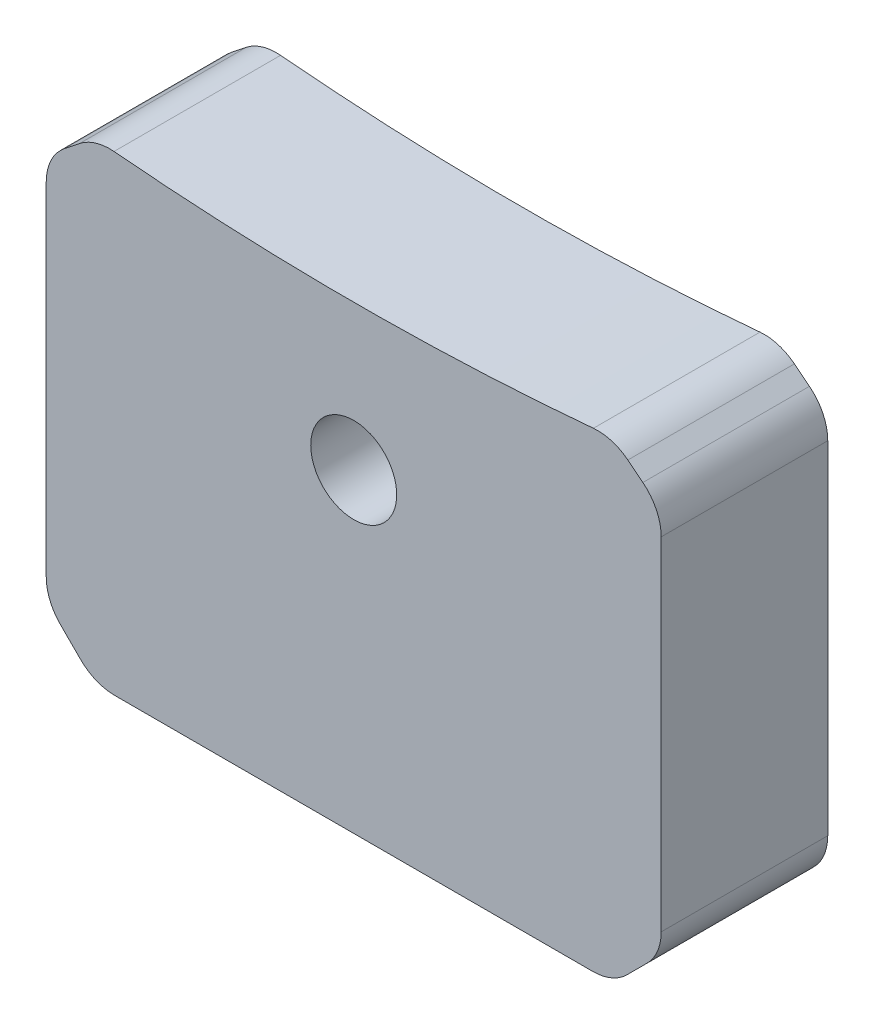
ISO-10303-21;
HEADER;
FILE_DESCRIPTION(('STEP AP214'),'2;1');
FILE_NAME('part.step','',(''),(''),'','','');
FILE_SCHEMA(('AUTOMOTIVE_DESIGN { 1 0 10303 214 1 1 1 1 }'));
ENDSEC;
DATA;
#1=APPLICATION_CONTEXT('core data for automotive mechanical design processes');
#2=APPLICATION_PROTOCOL_DEFINITION('international standard','automotive_design',2000,#1);
#3=PRODUCT_CONTEXT('',#1,'mechanical');
#4=PRODUCT('Part','Part','',(#3));
#5=PRODUCT_RELATED_PRODUCT_CATEGORY('part','',(#4));
#6=PRODUCT_DEFINITION_FORMATION('','',#4);
#7=PRODUCT_DEFINITION_CONTEXT('part definition',#1,'design');
#8=PRODUCT_DEFINITION('design','',#6,#7);
#9=PRODUCT_DEFINITION_SHAPE('','',#8);
#10=(LENGTH_UNIT() NAMED_UNIT(*) SI_UNIT(.MILLI.,.METRE.));
#11=(NAMED_UNIT(*) PLANE_ANGLE_UNIT() SI_UNIT($,.RADIAN.));
#12=(NAMED_UNIT(*) SI_UNIT($,.STERADIAN.) SOLID_ANGLE_UNIT());
#13=UNCERTAINTY_MEASURE_WITH_UNIT(LENGTH_MEASURE(1.E-05),#10,'distance_accuracy_value','');
#14=(GEOMETRIC_REPRESENTATION_CONTEXT(3) GLOBAL_UNCERTAINTY_ASSIGNED_CONTEXT((#13)) GLOBAL_UNIT_ASSIGNED_CONTEXT((#10,
#11,#12)) REPRESENTATION_CONTEXT('',''));
#15=CARTESIAN_POINT('',(0.,0.,0.));
#16=DIRECTION('',(0.,0.,1.));
#17=DIRECTION('',(1.,0.,0.));
#18=AXIS2_PLACEMENT_3D('',#15,#16,#17);
#19=CARTESIAN_POINT('',(-12.7,-16.15,6.88));
#20=DIRECTION('',(1.,0.,0.));
#21=DIRECTION('',(0.,0.,-1.));
#22=AXIS2_PLACEMENT_3D('',#19,#20,#21);
#23=PLANE('',#22);
#24=DIRECTION('',(0.,-1.,0.));
#25=VECTOR('',#24,1.);
#26=CARTESIAN_POINT('',(-12.7,-16.15,6.88));
#27=LINE('',#26,#25);
#28=CARTESIAN_POINT('',(-12.7,0.807433650841439,6.88));
#29=VERTEX_POINT('',#28);
#30=CARTESIAN_POINT('',(-12.7,-13.3215728752538,6.88));
#31=VERTEX_POINT('',#30);
#32=EDGE_CURVE('E185',#29,#31,#27,.T.);
#33=ORIENTED_EDGE('',*,*,#32,.F.);
#34=DIRECTION('',(0.,0.,1.));
#35=VECTOR('',#34,1.);
#36=CARTESIAN_POINT('',(-12.7,0.807433650841439,0.));
#37=LINE('',#36,#35);
#38=CARTESIAN_POINT('',(-12.7,0.807433650841439,0.));
#39=VERTEX_POINT('',#38);
#40=EDGE_CURVE('E253',#29,#39,#37,.F.);
#41=ORIENTED_EDGE('',*,*,#40,.T.);
#42=DIRECTION('',(0.,-1.,0.));
#43=VECTOR('',#42,1.);
#44=CARTESIAN_POINT('',(-12.7,-16.15,0.));
#45=LINE('',#44,#43);
#46=CARTESIAN_POINT('',(-12.7,-13.3215728752538,0.));
#47=VERTEX_POINT('',#46);
#48=EDGE_CURVE('E192',#39,#47,#45,.T.);
#49=ORIENTED_EDGE('',*,*,#48,.T.);
#50=DIRECTION('',(0.,0.,-1.));
#51=VECTOR('',#50,1.);
#52=CARTESIAN_POINT('',(-12.7,-13.3215728752538,6.88));
#53=LINE('',#52,#51);
#54=EDGE_CURVE('E250',#47,#31,#53,.F.);
#55=ORIENTED_EDGE('',*,*,#54,.T.);
#56=EDGE_LOOP('',(#33,#41,#49,#55));
#57=FACE_BOUND('',#56,.T.);
#58=ADVANCED_FACE('F41',(#57),#23,.F.);
#59=CARTESIAN_POINT('',(12.7,-16.15,6.88));
#60=DIRECTION('',(0.,1.,0.));
#61=DIRECTION('',(-1.,0.,0.));
#62=AXIS2_PLACEMENT_3D('',#59,#60,#61);
#63=PLANE('',#62);
#64=DIRECTION('',(1.,0.,0.));
#65=VECTOR('',#64,1.);
#66=CARTESIAN_POINT('',(12.7,-16.15,0.));
#67=LINE('',#66,#65);
#68=CARTESIAN_POINT('',(-9.87157287525381,-16.15,0.));
#69=VERTEX_POINT('',#68);
#70=CARTESIAN_POINT('',(9.87157287525381,-16.15,0.));
#71=VERTEX_POINT('',#70);
#72=EDGE_CURVE('E186',#69,#71,#67,.T.);
#73=ORIENTED_EDGE('',*,*,#72,.T.);
#74=DIRECTION('',(0.,0.,-1.));
#75=VECTOR('',#74,1.);
#76=CARTESIAN_POINT('',(9.87157287525381,-16.15,6.88));
#77=LINE('',#76,#75);
#78=CARTESIAN_POINT('',(9.87157287525381,-16.15,6.88));
#79=VERTEX_POINT('',#78);
#80=EDGE_CURVE('E248',#71,#79,#77,.F.);
#81=ORIENTED_EDGE('',*,*,#80,.T.);
#82=DIRECTION('',(1.,0.,0.));
#83=VECTOR('',#82,1.);
#84=CARTESIAN_POINT('',(12.7,-16.15,6.88));
#85=LINE('',#84,#83);
#86=CARTESIAN_POINT('',(-9.87157287525381,-16.15,6.88));
#87=VERTEX_POINT('',#86);
#88=EDGE_CURVE('E189',#87,#79,#85,.T.);
#89=ORIENTED_EDGE('',*,*,#88,.F.);
#90=DIRECTION('',(0.,0.,1.));
#91=VECTOR('',#90,1.);
#92=CARTESIAN_POINT('',(-9.87157287525381,-16.15,0.));
#93=LINE('',#92,#91);
#94=EDGE_CURVE('E245',#87,#69,#93,.F.);
#95=ORIENTED_EDGE('',*,*,#94,.T.);
#96=EDGE_LOOP('',(#73,#81,#89,#95));
#97=FACE_BOUND('',#96,.T.);
#98=ADVANCED_FACE('F330',(#97),#63,.F.);
#99=CARTESIAN_POINT('',(12.7,-16.15,6.88));
#100=DIRECTION('',(-1.,0.,0.));
#101=DIRECTION('',(0.,-1.,0.));
#102=AXIS2_PLACEMENT_3D('',#99,#100,#101);
#103=PLANE('',#102);
#104=DIRECTION('',(0.,1.,0.));
#105=VECTOR('',#104,1.);
#106=CARTESIAN_POINT('',(12.7,-16.15,6.88));
#107=LINE('',#106,#105);
#108=CARTESIAN_POINT('',(12.7,-13.3215728752538,6.88));
#109=VERTEX_POINT('',#108);
#110=CARTESIAN_POINT('',(12.7,0.807433650841443,6.88));
#111=VERTEX_POINT('',#110);
#112=EDGE_CURVE('E177',#109,#111,#107,.T.);
#113=ORIENTED_EDGE('',*,*,#112,.F.);
#114=DIRECTION('',(0.,0.,1.));
#115=VECTOR('',#114,1.);
#116=CARTESIAN_POINT('',(12.7,-13.3215728752538,0.));
#117=LINE('',#116,#115);
#118=CARTESIAN_POINT('',(12.7,-13.3215728752538,0.));
#119=VERTEX_POINT('',#118);
#120=EDGE_CURVE('E160',#109,#119,#117,.F.);
#121=ORIENTED_EDGE('',*,*,#120,.T.);
#122=DIRECTION('',(0.,1.,0.));
#123=VECTOR('',#122,1.);
#124=CARTESIAN_POINT('',(12.7,-16.15,0.));
#125=LINE('',#124,#123);
#126=CARTESIAN_POINT('',(12.7,0.807433650841443,0.));
#127=VERTEX_POINT('',#126);
#128=EDGE_CURVE('E174',#119,#127,#125,.T.);
#129=ORIENTED_EDGE('',*,*,#128,.T.);
#130=DIRECTION('',(0.,0.,1.));
#131=VECTOR('',#130,1.);
#132=CARTESIAN_POINT('',(12.7,0.807433650841443,6.88));
#133=LINE('',#132,#131);
#134=EDGE_CURVE('E179',#127,#111,#133,.T.);
#135=ORIENTED_EDGE('',*,*,#134,.T.);
#136=EDGE_LOOP('',(#113,#121,#129,#135));
#137=FACE_BOUND('',#136,.T.);
#138=ADVANCED_FACE('F172',(#137),#103,.F.);
#139=CARTESIAN_POINT('',(0.,0.,6.88));
#140=DIRECTION('',(0.,0.,1.));
#141=DIRECTION('',(1.,0.,0.));
#142=AXIS2_PLACEMENT_3D('',#139,#140,#141);
#143=PLANE('',#142);
#144=DIRECTION('',(-0.707106781186548,-0.707106781186547,0.));
#145=VECTOR('',#144,1.);
#146=CARTESIAN_POINT('',(13.425,-13.425,6.88));
#147=LINE('',#146,#145);
#148=CARTESIAN_POINT('',(11.2857864376269,-15.5642135623731,6.88));
#149=VERTEX_POINT('',#148);
#150=CARTESIAN_POINT('',(12.1142135623731,-14.7357864376269,6.88));
#151=VERTEX_POINT('',#150);
#152=EDGE_CURVE('E201',#149,#151,#147,.F.);
#153=ORIENTED_EDGE('',*,*,#152,.T.);
#154=CARTESIAN_POINT('',(10.7,-13.3215728752538,6.88));
#155=DIRECTION('',(0.,0.,1.));
#156=DIRECTION('',(1.,0.,0.));
#157=AXIS2_PLACEMENT_3D('',#154,#155,#156);
#158=CIRCLE('',#157,2.);
#159=EDGE_CURVE('E243',#151,#109,#158,.T.);
#160=ORIENTED_EDGE('',*,*,#159,.T.);
#161=ORIENTED_EDGE('',*,*,#112,.T.);
#162=CARTESIAN_POINT('',(10.7,0.807433650841443,6.88));
#163=DIRECTION('',(0.,0.,1.));
#164=DIRECTION('',(1.,0.,0.));
#165=AXIS2_PLACEMENT_3D('',#162,#163,#164);
#166=CIRCLE('',#165,2.);
#167=CARTESIAN_POINT('',(11.9431201592609,2.37416664329397,6.88));
#168=VERTEX_POINT('',#167);
#169=EDGE_CURVE('E234',#111,#168,#166,.T.);
#170=ORIENTED_EDGE('',*,*,#169,.T.);
#171=DIRECTION('',(-0.783366496226267,0.621560079630427,0.));
#172=VECTOR('',#171,1.);
#173=CARTESIAN_POINT('',(5.77007232543336,7.27215516034181,6.88));
#174=LINE('',#173,#172);
#175=CARTESIAN_POINT('',(11.3218599451759,2.86710392105358,6.88));
#176=VERTEX_POINT('',#175);
#177=EDGE_CURVE('E204',#168,#176,#174,.T.);
#178=ORIENTED_EDGE('',*,*,#177,.T.);
#179=CARTESIAN_POINT('',(10.0787397859151,1.30037092860106,6.88));
#180=DIRECTION('',(0.,0.,1.));
#181=DIRECTION('',(1.,0.,0.));
#182=AXIS2_PLACEMENT_3D('',#179,#180,#181);
#183=CIRCLE('',#182,2.);
#184=CARTESIAN_POINT('',(9.9003550109431,3.29239976174033,6.88));
#185=VERTEX_POINT('',#184);
#186=EDGE_CURVE('E236',#176,#185,#183,.T.);
#187=ORIENTED_EDGE('',*,*,#186,.T.);
#188=CARTESIAN_POINT('',(0.,113.85000000097,6.88));
#189=DIRECTION('',(0.,0.,-1.));
#190=DIRECTION('',(-1.,0.,0.));
#191=AXIS2_PLACEMENT_3D('',#188,#189,#190);
#192=CIRCLE('',#191,111.);
#193=CARTESIAN_POINT('',(-9.90035501094309,3.29239976174033,6.88));
#194=VERTEX_POINT('',#193);
#195=EDGE_CURVE('E292',#185,#194,#192,.T.);
#196=ORIENTED_EDGE('',*,*,#195,.T.);
#197=CARTESIAN_POINT('',(-10.078739785915,1.30037092860107,6.88));
#198=DIRECTION('',(0.,0.,1.));
#199=DIRECTION('',(1.,0.,0.));
#200=AXIS2_PLACEMENT_3D('',#197,#198,#199);
#201=CIRCLE('',#200,2.);
#202=CARTESIAN_POINT('',(-11.3218599451759,2.86710392105359,6.88));
#203=VERTEX_POINT('',#202);
#204=EDGE_CURVE('E238',#194,#203,#201,.T.);
#205=ORIENTED_EDGE('',*,*,#204,.T.);
#206=DIRECTION('',(0.783366496226267,0.621560079630426,0.));
#207=VECTOR('',#206,1.);
#208=CARTESIAN_POINT('',(-5.77007232543335,7.27215516034181,6.88));
#209=LINE('',#208,#207);
#210=CARTESIAN_POINT('',(-11.9431201592609,2.37416664329397,6.88));
#211=VERTEX_POINT('',#210);
#212=EDGE_CURVE('E198',#203,#211,#209,.F.);
#213=ORIENTED_EDGE('',*,*,#212,.T.);
#214=CARTESIAN_POINT('',(-10.7,0.807433650841439,6.88));
#215=DIRECTION('',(0.,0.,1.));
#216=DIRECTION('',(1.,0.,0.));
#217=AXIS2_PLACEMENT_3D('',#214,#215,#216);
#218=CIRCLE('',#217,2.);
#219=EDGE_CURVE('E240',#211,#29,#218,.T.);
#220=ORIENTED_EDGE('',*,*,#219,.T.);
#221=ORIENTED_EDGE('',*,*,#32,.T.);
#222=CARTESIAN_POINT('',(-10.7,-13.3215728752538,6.88));
#223=DIRECTION('',(0.,0.,1.));
#224=DIRECTION('',(1.,0.,0.));
#225=AXIS2_PLACEMENT_3D('',#222,#223,#224);
#226=CIRCLE('',#225,2.);
#227=CARTESIAN_POINT('',(-12.1142135623731,-14.7357864376269,6.88));
#228=VERTEX_POINT('',#227);
#229=EDGE_CURVE('E231',#31,#228,#226,.T.);
#230=ORIENTED_EDGE('',*,*,#229,.T.);
#231=DIRECTION('',(-0.707106781186547,0.707106781186548,0.));
#232=VECTOR('',#231,1.);
#233=CARTESIAN_POINT('',(-13.425,-13.425,6.88));
#234=LINE('',#233,#232);
#235=CARTESIAN_POINT('',(-11.2857864376269,-15.5642135623731,6.88));
#236=VERTEX_POINT('',#235);
#237=EDGE_CURVE('E196',#228,#236,#234,.F.);
#238=ORIENTED_EDGE('',*,*,#237,.T.);
#239=CARTESIAN_POINT('',(-9.87157287525381,-14.15,6.88));
#240=DIRECTION('',(0.,0.,1.));
#241=DIRECTION('',(1.,0.,0.));
#242=AXIS2_PLACEMENT_3D('',#239,#240,#241);
#243=CIRCLE('',#242,2.);
#244=EDGE_CURVE('E64',#236,#87,#243,.T.);
#245=ORIENTED_EDGE('',*,*,#244,.T.);
#246=ORIENTED_EDGE('',*,*,#88,.T.);
#247=CARTESIAN_POINT('',(9.87157287525381,-14.15,6.88));
#248=DIRECTION('',(0.,0.,1.));
#249=DIRECTION('',(1.,0.,0.));
#250=AXIS2_PLACEMENT_3D('',#247,#248,#249);
#251=CIRCLE('',#250,2.);
#252=EDGE_CURVE('E56',#79,#149,#251,.T.);
#253=ORIENTED_EDGE('',*,*,#252,.T.);
#254=EDGE_LOOP('',(#153,#160,#161,#170,#178,#187,#196,#205,#213,#220,#221,#230,#238,#245,#246,#253));
#255=FACE_BOUND('',#254,.T.);
#256=CARTESIAN_POINT('',(0.,-3.14999999902921,6.88));
#257=DIRECTION('',(0.,0.,-1.));
#258=DIRECTION('',(-1.,0.,0.));
#259=AXIS2_PLACEMENT_3D('',#256,#257,#258);
#260=CIRCLE('',#259,1.775);
#261=CARTESIAN_POINT('',(-1.77499999999996,-3.14999999902921,6.88));
#262=VERTEX_POINT('',#261);
#263=EDGE_CURVE('E302',#262,#262,#260,.T.);
#264=ORIENTED_EDGE('',*,*,#263,.T.);
#265=EDGE_LOOP('',(#264));
#266=FACE_BOUND('',#265,.T.);
#267=ADVANCED_FACE('F284',(#255,#266),#143,.T.);
#268=CARTESIAN_POINT('',(0.,0.,0.));
#269=DIRECTION('',(0.,0.,1.));
#270=DIRECTION('',(1.,0.,0.));
#271=AXIS2_PLACEMENT_3D('',#268,#269,#270);
#272=PLANE('',#271);
#273=CARTESIAN_POINT('',(0.,-3.14999999902921,0.));
#274=DIRECTION('',(0.,0.,-1.));
#275=DIRECTION('',(-1.,0.,0.));
#276=AXIS2_PLACEMENT_3D('',#273,#274,#275);
#277=CIRCLE('',#276,1.775);
#278=CARTESIAN_POINT('',(-1.77499999999996,-3.14999999902921,0.));
#279=VERTEX_POINT('',#278);
#280=EDGE_CURVE('E299',#279,#279,#277,.T.);
#281=ORIENTED_EDGE('',*,*,#280,.F.);
#282=EDGE_LOOP('',(#281));
#283=FACE_BOUND('',#282,.T.);
#284=ORIENTED_EDGE('',*,*,#128,.F.);
#285=CARTESIAN_POINT('',(10.7,-13.3215728752538,0.));
#286=DIRECTION('',(0.,0.,1.));
#287=DIRECTION('',(1.,0.,0.));
#288=AXIS2_PLACEMENT_3D('',#285,#286,#287);
#289=CIRCLE('',#288,2.);
#290=CARTESIAN_POINT('',(12.1142135623731,-14.7357864376269,0.));
#291=VERTEX_POINT('',#290);
#292=EDGE_CURVE('E156',#119,#291,#289,.F.);
#293=ORIENTED_EDGE('',*,*,#292,.T.);
#294=DIRECTION('',(0.707106781186548,0.707106781186547,0.));
#295=VECTOR('',#294,1.);
#296=CARTESIAN_POINT('',(12.7,-14.15,0.));
#297=LINE('',#296,#295);
#298=CARTESIAN_POINT('',(11.2857864376269,-15.5642135623731,0.));
#299=VERTEX_POINT('',#298);
#300=EDGE_CURVE('E213',#291,#299,#297,.F.);
#301=ORIENTED_EDGE('',*,*,#300,.T.);
#302=CARTESIAN_POINT('',(9.87157287525381,-14.15,0.));
#303=DIRECTION('',(0.,0.,1.));
#304=DIRECTION('',(1.,0.,0.));
#305=AXIS2_PLACEMENT_3D('',#302,#303,#304);
#306=CIRCLE('',#305,2.);
#307=EDGE_CURVE('E167',#299,#71,#306,.F.);
#308=ORIENTED_EDGE('',*,*,#307,.T.);
#309=ORIENTED_EDGE('',*,*,#72,.F.);
#310=CARTESIAN_POINT('',(-9.87157287525381,-14.15,0.));
#311=DIRECTION('',(0.,0.,1.));
#312=DIRECTION('',(1.,0.,0.));
#313=AXIS2_PLACEMENT_3D('',#310,#311,#312);
#314=CIRCLE('',#313,2.);
#315=CARTESIAN_POINT('',(-11.2857864376269,-15.5642135623731,0.));
#316=VERTEX_POINT('',#315);
#317=EDGE_CURVE('E219',#69,#316,#314,.F.);
#318=ORIENTED_EDGE('',*,*,#317,.T.);
#319=DIRECTION('',(0.707106781186547,-0.707106781186548,0.));
#320=VECTOR('',#319,1.);
#321=CARTESIAN_POINT('',(-10.7,-16.15,0.));
#322=LINE('',#321,#320);
#323=CARTESIAN_POINT('',(-12.1142135623731,-14.7357864376269,0.));
#324=VERTEX_POINT('',#323);
#325=EDGE_CURVE('E207',#316,#324,#322,.F.);
#326=ORIENTED_EDGE('',*,*,#325,.T.);
#327=CARTESIAN_POINT('',(-10.7,-13.3215728752538,0.));
#328=DIRECTION('',(0.,0.,1.));
#329=DIRECTION('',(1.,0.,0.));
#330=AXIS2_PLACEMENT_3D('',#327,#328,#329);
#331=CIRCLE('',#330,2.);
#332=EDGE_CURVE('E178',#324,#47,#331,.F.);
#333=ORIENTED_EDGE('',*,*,#332,.T.);
#334=ORIENTED_EDGE('',*,*,#48,.F.);
#335=CARTESIAN_POINT('',(-10.7,0.807433650841439,0.));
#336=DIRECTION('',(0.,0.,1.));
#337=DIRECTION('',(1.,0.,0.));
#338=AXIS2_PLACEMENT_3D('',#335,#336,#337);
#339=CIRCLE('',#338,2.);
#340=CARTESIAN_POINT('',(-11.9431201592609,2.37416664329397,0.));
#341=VERTEX_POINT('',#340);
#342=EDGE_CURVE('E226',#39,#341,#339,.F.);
#343=ORIENTED_EDGE('',*,*,#342,.T.);
#344=DIRECTION('',(-0.783366496226267,-0.621560079630426,0.));
#345=VECTOR('',#344,1.);
#346=CARTESIAN_POINT('',(-12.7,1.77362233057855,0.));
#347=LINE('',#346,#345);
#348=CARTESIAN_POINT('',(-11.3218599451759,2.86710392105359,0.));
#349=VERTEX_POINT('',#348);
#350=EDGE_CURVE('E210',#341,#349,#347,.F.);
#351=ORIENTED_EDGE('',*,*,#350,.T.);
#352=CARTESIAN_POINT('',(-10.078739785915,1.30037092860107,0.));
#353=DIRECTION('',(0.,0.,1.));
#354=DIRECTION('',(1.,0.,0.));
#355=AXIS2_PLACEMENT_3D('',#352,#353,#354);
#356=CIRCLE('',#355,2.);
#357=CARTESIAN_POINT('',(-9.90035501094309,3.29239976174033,0.));
#358=VERTEX_POINT('',#357);
#359=EDGE_CURVE('E224',#349,#358,#356,.F.);
#360=ORIENTED_EDGE('',*,*,#359,.T.);
#361=CARTESIAN_POINT('',(0.,113.85000000097,0.));
#362=DIRECTION('',(0.,0.,-1.));
#363=DIRECTION('',(-1.,0.,0.));
#364=AXIS2_PLACEMENT_3D('',#361,#362,#363);
#365=CIRCLE('',#364,111.);
#366=CARTESIAN_POINT('',(9.9003550109431,3.29239976174033,0.));
#367=VERTEX_POINT('',#366);
#368=EDGE_CURVE('E294',#367,#358,#365,.T.);
#369=ORIENTED_EDGE('',*,*,#368,.F.);
#370=CARTESIAN_POINT('',(10.0787397859151,1.30037092860106,0.));
#371=DIRECTION('',(0.,0.,1.));
#372=DIRECTION('',(1.,0.,0.));
#373=AXIS2_PLACEMENT_3D('',#370,#371,#372);
#374=CIRCLE('',#373,2.);
#375=CARTESIAN_POINT('',(11.3218599451759,2.86710392105358,0.));
#376=VERTEX_POINT('',#375);
#377=EDGE_CURVE('E222',#367,#376,#374,.F.);
#378=ORIENTED_EDGE('',*,*,#377,.T.);
#379=DIRECTION('',(0.783366496226267,-0.621560079630427,0.));
#380=VECTOR('',#379,1.);
#381=CARTESIAN_POINT('',(12.7,1.77362233057855,0.));
#382=LINE('',#381,#380);
#383=CARTESIAN_POINT('',(11.9431201592609,2.37416664329397,0.));
#384=VERTEX_POINT('',#383);
#385=EDGE_CURVE('E215',#376,#384,#382,.T.);
#386=ORIENTED_EDGE('',*,*,#385,.T.);
#387=CARTESIAN_POINT('',(10.7,0.807433650841443,0.));
#388=DIRECTION('',(0.,0.,1.));
#389=DIRECTION('',(1.,0.,0.));
#390=AXIS2_PLACEMENT_3D('',#387,#388,#389);
#391=CIRCLE('',#390,2.);
#392=EDGE_CURVE('E184',#384,#127,#391,.F.);
#393=ORIENTED_EDGE('',*,*,#392,.T.);
#394=EDGE_LOOP('',(#284,#293,#301,#308,#309,#318,#326,#333,#334,#343,#351,#360,#369,#378,#386,#393));
#395=FACE_BOUND('',#394,.T.);
#396=ADVANCED_FACE('F181',(#283,#395),#272,.F.);
#397=CARTESIAN_POINT('',(0.,-3.14999999902921,6.88));
#398=DIRECTION('',(0.,0.,-1.));
#399=DIRECTION('',(-1.,0.,0.));
#400=AXIS2_PLACEMENT_3D('',#397,#398,#399);
#401=CYLINDRICAL_SURFACE('',#400,1.775);
#402=ORIENTED_EDGE('',*,*,#263,.F.);
#403=EDGE_LOOP('',(#402));
#404=FACE_BOUND('',#403,.T.);
#405=ORIENTED_EDGE('',*,*,#280,.T.);
#406=EDGE_LOOP('',(#405));
#407=FACE_BOUND('',#406,.T.);
#408=ADVANCED_FACE('F345',(#404,#407),#401,.F.);
#409=CARTESIAN_POINT('',(0.,113.85000000097,6.88));
#410=DIRECTION('',(0.,0.,-1.));
#411=DIRECTION('',(-1.,0.,0.));
#412=AXIS2_PLACEMENT_3D('',#409,#410,#411);
#413=CYLINDRICAL_SURFACE('',#412,111.);
#414=ORIENTED_EDGE('',*,*,#368,.T.);
#415=DIRECTION('',(0.,0.,-1.));
#416=VECTOR('',#415,1.);
#417=CARTESIAN_POINT('',(-9.90035501094309,3.29239976174031,6.88));
#418=LINE('',#417,#416);
#419=EDGE_CURVE('E263',#358,#194,#418,.F.);
#420=ORIENTED_EDGE('',*,*,#419,.T.);
#421=ORIENTED_EDGE('',*,*,#195,.F.);
#422=DIRECTION('',(0.,0.,-1.));
#423=VECTOR('',#422,1.);
#424=CARTESIAN_POINT('',(9.9003550109431,3.29239976174033,6.88));
#425=LINE('',#424,#423);
#426=EDGE_CURVE('E260',#185,#367,#425,.T.);
#427=ORIENTED_EDGE('',*,*,#426,.T.);
#428=EDGE_LOOP('',(#414,#420,#421,#427));
#429=FACE_BOUND('',#428,.T.);
#430=ADVANCED_FACE('F309',(#429),#413,.F.);
#431=CARTESIAN_POINT('',(12.7,1.77362233057855,6.88));
#432=DIRECTION('',(0.621560079630427,0.783366496226266,0.));
#433=DIRECTION('',(0.,0.,-1.));
#434=AXIS2_PLACEMENT_3D('',#431,#432,#433);
#435=PLANE('',#434);
#436=ORIENTED_EDGE('',*,*,#385,.F.);
#437=DIRECTION('',(0.,0.,1.));
#438=VECTOR('',#437,1.);
#439=CARTESIAN_POINT('',(11.3218599451759,2.86710392105358,6.88));
#440=LINE('',#439,#438);
#441=EDGE_CURVE('E268',#376,#176,#440,.T.);
#442=ORIENTED_EDGE('',*,*,#441,.T.);
#443=ORIENTED_EDGE('',*,*,#177,.F.);
#444=DIRECTION('',(0.,0.,1.));
#445=VECTOR('',#444,1.);
#446=CARTESIAN_POINT('',(11.9431201592609,2.37416664329397,0.));
#447=LINE('',#446,#445);
#448=EDGE_CURVE('E266',#168,#384,#447,.F.);
#449=ORIENTED_EDGE('',*,*,#448,.T.);
#450=EDGE_LOOP('',(#436,#442,#443,#449));
#451=FACE_BOUND('',#450,.T.);
#452=ADVANCED_FACE('F326',(#451),#435,.T.);
#453=CARTESIAN_POINT('',(12.7,-14.15,6.88));
#454=DIRECTION('',(-0.707106781186547,0.707106781186548,0.));
#455=DIRECTION('',(0.,0.,-1.));
#456=AXIS2_PLACEMENT_3D('',#453,#454,#455);
#457=PLANE('',#456);
#458=ORIENTED_EDGE('',*,*,#300,.F.);
#459=DIRECTION('',(0.,0.,-1.));
#460=VECTOR('',#459,1.);
#461=CARTESIAN_POINT('',(12.1142135623731,-14.7357864376269,6.88));
#462=LINE('',#461,#460);
#463=EDGE_CURVE('E161',#291,#151,#462,.F.);
#464=ORIENTED_EDGE('',*,*,#463,.T.);
#465=ORIENTED_EDGE('',*,*,#152,.F.);
#466=DIRECTION('',(0.,0.,1.));
#467=VECTOR('',#466,1.);
#468=CARTESIAN_POINT('',(11.2857864376269,-15.5642135623731,0.));
#469=LINE('',#468,#467);
#470=EDGE_CURVE('E166',#149,#299,#469,.F.);
#471=ORIENTED_EDGE('',*,*,#470,.T.);
#472=EDGE_LOOP('',(#458,#464,#465,#471));
#473=FACE_BOUND('',#472,.T.);
#474=ADVANCED_FACE('F319',(#473),#457,.F.);
#475=CARTESIAN_POINT('',(-12.7,1.77362233057855,6.88));
#476=DIRECTION('',(0.621560079630426,-0.783366496226267,0.));
#477=DIRECTION('',(0.,0.,-1.));
#478=AXIS2_PLACEMENT_3D('',#475,#476,#477);
#479=PLANE('',#478);
#480=ORIENTED_EDGE('',*,*,#350,.F.);
#481=DIRECTION('',(0.,0.,-1.));
#482=VECTOR('',#481,1.);
#483=CARTESIAN_POINT('',(-11.9431201592609,2.37416664329397,6.88));
#484=LINE('',#483,#482);
#485=EDGE_CURVE('E258',#341,#211,#484,.F.);
#486=ORIENTED_EDGE('',*,*,#485,.T.);
#487=ORIENTED_EDGE('',*,*,#212,.F.);
#488=DIRECTION('',(0.,0.,-1.));
#489=VECTOR('',#488,1.);
#490=CARTESIAN_POINT('',(-11.3218599451759,2.86710392105359,0.));
#491=LINE('',#490,#489);
#492=EDGE_CURVE('E256',#203,#349,#491,.T.);
#493=ORIENTED_EDGE('',*,*,#492,.T.);
#494=EDGE_LOOP('',(#480,#486,#487,#493));
#495=FACE_BOUND('',#494,.T.);
#496=ADVANCED_FACE('F317',(#495),#479,.F.);
#497=CARTESIAN_POINT('',(-10.7,-16.15,6.88));
#498=DIRECTION('',(0.707106781186548,0.707106781186547,0.));
#499=DIRECTION('',(0.,0.,-1.));
#500=AXIS2_PLACEMENT_3D('',#497,#498,#499);
#501=PLANE('',#500);
#502=ORIENTED_EDGE('',*,*,#325,.F.);
#503=DIRECTION('',(0.,0.,-1.));
#504=VECTOR('',#503,1.);
#505=CARTESIAN_POINT('',(-11.2857864376269,-15.5642135623731,6.88));
#506=LINE('',#505,#504);
#507=EDGE_CURVE('E11',#316,#236,#506,.F.);
#508=ORIENTED_EDGE('',*,*,#507,.T.);
#509=ORIENTED_EDGE('',*,*,#237,.F.);
#510=DIRECTION('',(0.,0.,1.));
#511=VECTOR('',#510,1.);
#512=CARTESIAN_POINT('',(-12.1142135623731,-14.7357864376269,0.));
#513=LINE('',#512,#511);
#514=EDGE_CURVE('E49',#228,#324,#513,.F.);
#515=ORIENTED_EDGE('',*,*,#514,.T.);
#516=EDGE_LOOP('',(#502,#508,#509,#515));
#517=FACE_BOUND('',#516,.T.);
#518=ADVANCED_FACE('F273',(#517),#501,.F.);
#519=CARTESIAN_POINT('',(10.7,-13.3215728752538,6.88));
#520=DIRECTION('',(0.,0.,-1.));
#521=DIRECTION('',(-1.,0.,0.));
#522=AXIS2_PLACEMENT_3D('',#519,#520,#521);
#523=CYLINDRICAL_SURFACE('',#522,2.);
#524=ORIENTED_EDGE('',*,*,#159,.F.);
#525=ORIENTED_EDGE('',*,*,#463,.F.);
#526=ORIENTED_EDGE('',*,*,#292,.F.);
#527=ORIENTED_EDGE('',*,*,#120,.F.);
#528=EDGE_LOOP('',(#524,#525,#526,#527));
#529=FACE_BOUND('',#528,.T.);
#530=ADVANCED_FACE('F159',(#529),#523,.T.);
#531=CARTESIAN_POINT('',(9.87157287525381,-14.15,6.88));
#532=DIRECTION('',(0.,0.,1.));
#533=DIRECTION('',(1.,0.,0.));
#534=AXIS2_PLACEMENT_3D('',#531,#532,#533);
#535=CYLINDRICAL_SURFACE('',#534,2.);
#536=ORIENTED_EDGE('',*,*,#307,.F.);
#537=ORIENTED_EDGE('',*,*,#470,.F.);
#538=ORIENTED_EDGE('',*,*,#252,.F.);
#539=ORIENTED_EDGE('',*,*,#80,.F.);
#540=EDGE_LOOP('',(#536,#537,#538,#539));
#541=FACE_BOUND('',#540,.T.);
#542=ADVANCED_FACE('F358',(#541),#535,.T.);
#543=CARTESIAN_POINT('',(-10.7,0.807433650841439,6.88));
#544=DIRECTION('',(0.,0.,-1.));
#545=DIRECTION('',(-1.,0.,0.));
#546=AXIS2_PLACEMENT_3D('',#543,#544,#545);
#547=CYLINDRICAL_SURFACE('',#546,2.);
#548=ORIENTED_EDGE('',*,*,#219,.F.);
#549=ORIENTED_EDGE('',*,*,#485,.F.);
#550=ORIENTED_EDGE('',*,*,#342,.F.);
#551=ORIENTED_EDGE('',*,*,#40,.F.);
#552=EDGE_LOOP('',(#548,#549,#550,#551));
#553=FACE_BOUND('',#552,.T.);
#554=ADVANCED_FACE('F290',(#553),#547,.T.);
#555=CARTESIAN_POINT('',(-10.078739785915,1.30037092860107,6.88));
#556=DIRECTION('',(0.,0.,-1.));
#557=DIRECTION('',(-1.,0.,0.));
#558=AXIS2_PLACEMENT_3D('',#555,#556,#557);
#559=CYLINDRICAL_SURFACE('',#558,2.);
#560=ORIENTED_EDGE('',*,*,#359,.F.);
#561=ORIENTED_EDGE('',*,*,#492,.F.);
#562=ORIENTED_EDGE('',*,*,#204,.F.);
#563=ORIENTED_EDGE('',*,*,#419,.F.);
#564=EDGE_LOOP('',(#560,#561,#562,#563));
#565=FACE_BOUND('',#564,.T.);
#566=ADVANCED_FACE('F314',(#565),#559,.T.);
#567=CARTESIAN_POINT('',(10.0787397859151,1.30037092860106,6.88));
#568=DIRECTION('',(0.,0.,-1.));
#569=DIRECTION('',(-1.,0.,0.));
#570=AXIS2_PLACEMENT_3D('',#567,#568,#569);
#571=CYLINDRICAL_SURFACE('',#570,2.);
#572=ORIENTED_EDGE('',*,*,#186,.F.);
#573=ORIENTED_EDGE('',*,*,#441,.F.);
#574=ORIENTED_EDGE('',*,*,#377,.F.);
#575=ORIENTED_EDGE('',*,*,#426,.F.);
#576=EDGE_LOOP('',(#572,#573,#574,#575));
#577=FACE_BOUND('',#576,.T.);
#578=ADVANCED_FACE('F353',(#577),#571,.T.);
#579=CARTESIAN_POINT('',(10.7,0.807433650841443,6.88));
#580=DIRECTION('',(0.,0.,-1.));
#581=DIRECTION('',(-1.,0.,0.));
#582=AXIS2_PLACEMENT_3D('',#579,#580,#581);
#583=CYLINDRICAL_SURFACE('',#582,2.);
#584=ORIENTED_EDGE('',*,*,#392,.F.);
#585=ORIENTED_EDGE('',*,*,#448,.F.);
#586=ORIENTED_EDGE('',*,*,#169,.F.);
#587=ORIENTED_EDGE('',*,*,#134,.F.);
#588=EDGE_LOOP('',(#584,#585,#586,#587));
#589=FACE_BOUND('',#588,.T.);
#590=ADVANCED_FACE('F355',(#589),#583,.T.);
#591=CARTESIAN_POINT('',(-9.87157287525381,-14.15,6.88));
#592=DIRECTION('',(0.,0.,-1.));
#593=DIRECTION('',(-1.,0.,0.));
#594=AXIS2_PLACEMENT_3D('',#591,#592,#593);
#595=CYLINDRICAL_SURFACE('',#594,2.);
#596=ORIENTED_EDGE('',*,*,#244,.F.);
#597=ORIENTED_EDGE('',*,*,#507,.F.);
#598=ORIENTED_EDGE('',*,*,#317,.F.);
#599=ORIENTED_EDGE('',*,*,#94,.F.);
#600=EDGE_LOOP('',(#596,#597,#598,#599));
#601=FACE_BOUND('',#600,.T.);
#602=ADVANCED_FACE('F361',(#601),#595,.T.);
#603=CARTESIAN_POINT('',(-10.7,-13.3215728752538,6.88));
#604=DIRECTION('',(0.,0.,1.));
#605=DIRECTION('',(1.,0.,0.));
#606=AXIS2_PLACEMENT_3D('',#603,#604,#605);
#607=CYLINDRICAL_SURFACE('',#606,2.);
#608=ORIENTED_EDGE('',*,*,#332,.F.);
#609=ORIENTED_EDGE('',*,*,#514,.F.);
#610=ORIENTED_EDGE('',*,*,#229,.F.);
#611=ORIENTED_EDGE('',*,*,#54,.F.);
#612=EDGE_LOOP('',(#608,#609,#610,#611));
#613=FACE_BOUND('',#612,.T.);
#614=ADVANCED_FACE('F43',(#613),#607,.T.);
#615=CLOSED_SHELL('',(#58,#98,#138,#267,#396,#408,#430,#452,#474,#496,#518,#530,#542,#554,#566,
#578,#590,#602,#614));
#616=MANIFOLD_SOLID_BREP('B2',#615);
#617=ADVANCED_BREP_SHAPE_REPRESENTATION('',(#18,#616),#14);
#618=SHAPE_DEFINITION_REPRESENTATION(#9,#617);
ENDSEC;
END-ISO-10303-21;
